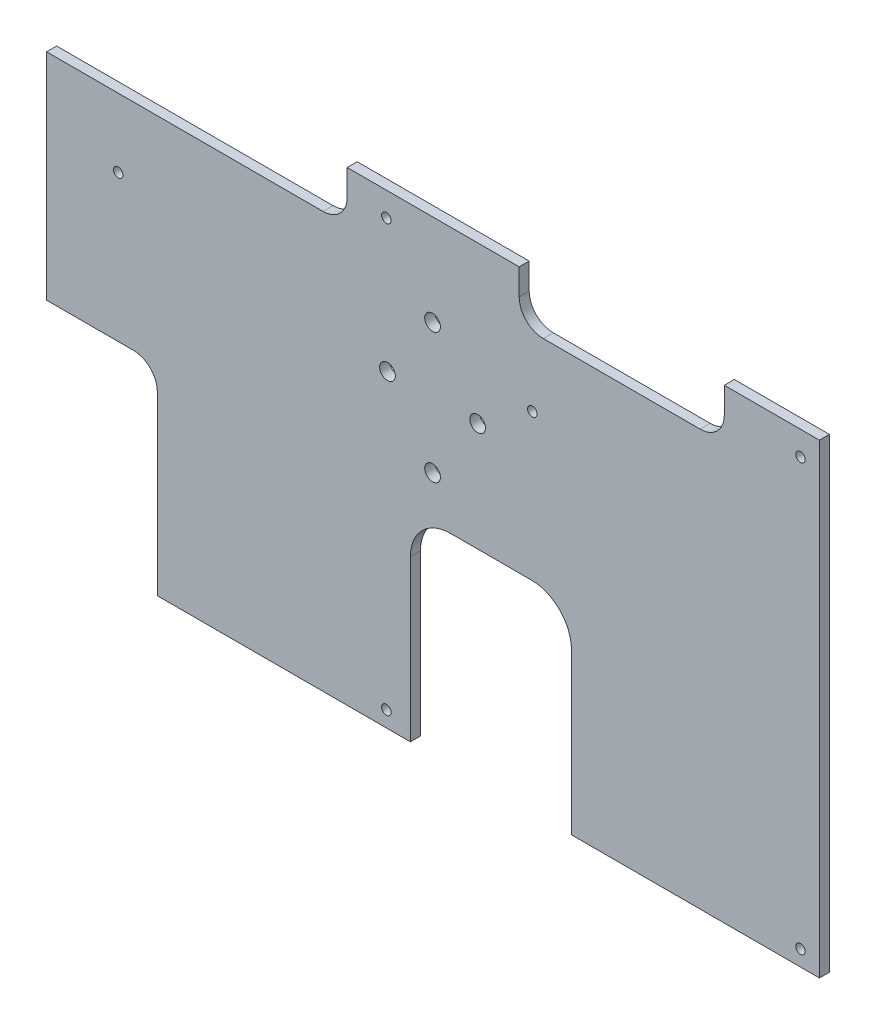
ISO-10303-21;
HEADER;
FILE_DESCRIPTION(('STEP AP214'),'2;1');
FILE_NAME('part.step','',(''),(''),'','','');
FILE_SCHEMA(('AUTOMOTIVE_DESIGN { 1 0 10303 214 1 1 1 1 }'));
ENDSEC;
DATA;
#1=APPLICATION_CONTEXT('core data for automotive mechanical design processes');
#2=APPLICATION_PROTOCOL_DEFINITION('international standard','automotive_design',2000,#1);
#3=PRODUCT_CONTEXT('',#1,'mechanical');
#4=PRODUCT('Part','Part','',(#3));
#5=PRODUCT_RELATED_PRODUCT_CATEGORY('part','',(#4));
#6=PRODUCT_DEFINITION_FORMATION('','',#4);
#7=PRODUCT_DEFINITION_CONTEXT('part definition',#1,'design');
#8=PRODUCT_DEFINITION('design','',#6,#7);
#9=PRODUCT_DEFINITION_SHAPE('','',#8);
#10=(LENGTH_UNIT() NAMED_UNIT(*) SI_UNIT(.MILLI.,.METRE.));
#11=(NAMED_UNIT(*) PLANE_ANGLE_UNIT() SI_UNIT($,.RADIAN.));
#12=(NAMED_UNIT(*) SI_UNIT($,.STERADIAN.) SOLID_ANGLE_UNIT());
#13=UNCERTAINTY_MEASURE_WITH_UNIT(LENGTH_MEASURE(1.E-05),#10,'distance_accuracy_value','');
#14=(GEOMETRIC_REPRESENTATION_CONTEXT(3) GLOBAL_UNCERTAINTY_ASSIGNED_CONTEXT((#13)) GLOBAL_UNIT_ASSIGNED_CONTEXT((#10,
#11,#12)) REPRESENTATION_CONTEXT('',''));
#15=CARTESIAN_POINT('',(0.,0.,0.));
#16=DIRECTION('',(0.,0.,1.));
#17=DIRECTION('',(1.,0.,0.));
#18=AXIS2_PLACEMENT_3D('',#15,#16,#17);
#19=CARTESIAN_POINT('',(290.913803271986,0.,3.175));
#20=DIRECTION('',(-1.,0.,0.));
#21=DIRECTION('',(0.,0.,1.));
#22=AXIS2_PLACEMENT_3D('',#19,#20,#21);
#23=PLANE('',#22);
#24=DIRECTION('',(0.,1.,0.));
#25=VECTOR('',#24,1.);
#26=CARTESIAN_POINT('',(290.913803271986,0.,0.));
#27=LINE('',#26,#25);
#28=CARTESIAN_POINT('',(290.913803271986,301.91999065022,0.));
#29=VERTEX_POINT('',#28);
#30=CARTESIAN_POINT('',(290.913803271986,310.17499065022,0.));
#31=VERTEX_POINT('',#30);
#32=EDGE_CURVE('E246',#29,#31,#27,.T.);
#33=ORIENTED_EDGE('',*,*,#32,.F.);
#34=DIRECTION('',(0.,0.,-1.));
#35=VECTOR('',#34,1.);
#36=CARTESIAN_POINT('',(290.913803271986,301.91999065022,3.175));
#37=LINE('',#36,#35);
#38=CARTESIAN_POINT('',(290.913803271986,301.91999065022,3.175));
#39=VERTEX_POINT('',#38);
#40=EDGE_CURVE('E11',#39,#29,#37,.T.);
#41=ORIENTED_EDGE('',*,*,#40,.F.);
#42=DIRECTION('',(0.,1.,0.));
#43=VECTOR('',#42,1.);
#44=CARTESIAN_POINT('',(290.913803271986,0.,3.175));
#45=LINE('',#44,#43);
#46=CARTESIAN_POINT('',(290.913803271986,310.17499065022,3.175));
#47=VERTEX_POINT('',#46);
#48=EDGE_CURVE('E367',#39,#47,#45,.T.);
#49=ORIENTED_EDGE('',*,*,#48,.T.);
#50=DIRECTION('',(0.,0.,-1.));
#51=VECTOR('',#50,1.);
#52=CARTESIAN_POINT('',(290.913803271986,310.17499065022,3.175));
#53=LINE('',#52,#51);
#54=EDGE_CURVE('E54',#47,#31,#53,.T.);
#55=ORIENTED_EDGE('',*,*,#54,.T.);
#56=EDGE_LOOP('',(#33,#41,#49,#55));
#57=FACE_BOUND('',#56,.T.);
#58=ADVANCED_FACE('F37',(#57),#23,.T.);
#59=CARTESIAN_POINT('',(283.293803271986,301.91999065022,3.175));
#60=DIRECTION('',(0.,0.,-1.));
#61=DIRECTION('',(-1.,0.,0.));
#62=AXIS2_PLACEMENT_3D('',#59,#60,#61);
#63=CYLINDRICAL_SURFACE('',#62,7.62000000000002);
#64=CARTESIAN_POINT('',(283.293803271986,301.91999065022,0.));
#65=DIRECTION('',(0.,0.,1.));
#66=DIRECTION('',(1.,0.,0.));
#67=AXIS2_PLACEMENT_3D('',#64,#65,#66);
#68=CIRCLE('',#67,7.62000000000002);
#69=CARTESIAN_POINT('',(283.293803271986,294.29999065022,0.));
#70=VERTEX_POINT('',#69);
#71=EDGE_CURVE('E248',#29,#70,#68,.F.);
#72=ORIENTED_EDGE('',*,*,#71,.T.);
#73=DIRECTION('',(0.,0.,-1.));
#74=VECTOR('',#73,1.);
#75=CARTESIAN_POINT('',(283.293803271986,294.29999065022,3.175));
#76=LINE('',#75,#74);
#77=CARTESIAN_POINT('',(283.293803271986,294.29999065022,3.175));
#78=VERTEX_POINT('',#77);
#79=EDGE_CURVE('E46',#78,#70,#76,.T.);
#80=ORIENTED_EDGE('',*,*,#79,.F.);
#81=CARTESIAN_POINT('',(283.293803271986,301.91999065022,3.175));
#82=DIRECTION('',(0.,0.,1.));
#83=DIRECTION('',(1.,0.,0.));
#84=AXIS2_PLACEMENT_3D('',#81,#82,#83);
#85=CIRCLE('',#84,7.62000000000002);
#86=EDGE_CURVE('E363',#39,#78,#85,.F.);
#87=ORIENTED_EDGE('',*,*,#86,.F.);
#88=ORIENTED_EDGE('',*,*,#40,.T.);
#89=EDGE_LOOP('',(#72,#80,#87,#88));
#90=FACE_BOUND('',#89,.T.);
#91=ADVANCED_FACE('F350',(#90),#63,.F.);
#92=CARTESIAN_POINT('',(0.,294.29999065022,3.175));
#93=DIRECTION('',(0.,1.,0.));
#94=DIRECTION('',(0.,0.,1.));
#95=AXIS2_PLACEMENT_3D('',#92,#93,#94);
#96=PLANE('',#95);
#97=DIRECTION('',(1.,0.,0.));
#98=VECTOR('',#97,1.);
#99=CARTESIAN_POINT('',(0.,294.29999065022,0.));
#100=LINE('',#99,#98);
#101=CARTESIAN_POINT('',(195.647245606741,294.29999065022,0.));
#102=VERTEX_POINT('',#101);
#103=EDGE_CURVE('E251',#102,#70,#100,.T.);
#104=ORIENTED_EDGE('',*,*,#103,.F.);
#105=DIRECTION('',(0.,0.,-1.));
#106=VECTOR('',#105,1.);
#107=CARTESIAN_POINT('',(195.647245606741,294.29999065022,3.175));
#108=LINE('',#107,#106);
#109=CARTESIAN_POINT('',(195.647245606741,294.29999065022,3.175));
#110=VERTEX_POINT('',#109);
#111=EDGE_CURVE('E340',#110,#102,#108,.T.);
#112=ORIENTED_EDGE('',*,*,#111,.F.);
#113=DIRECTION('',(1.,0.,0.));
#114=VECTOR('',#113,1.);
#115=CARTESIAN_POINT('',(0.,294.29999065022,3.175));
#116=LINE('',#115,#114);
#117=EDGE_CURVE('E347',#110,#78,#116,.T.);
#118=ORIENTED_EDGE('',*,*,#117,.T.);
#119=ORIENTED_EDGE('',*,*,#79,.T.);
#120=EDGE_LOOP('',(#104,#112,#118,#119));
#121=FACE_BOUND('',#120,.T.);
#122=ADVANCED_FACE('F345',(#121),#96,.T.);
#123=CARTESIAN_POINT('',(195.647245606741,0.,3.175));
#124=DIRECTION('',(-1.,0.,0.));
#125=DIRECTION('',(0.,0.,1.));
#126=AXIS2_PLACEMENT_3D('',#123,#124,#125);
#127=PLANE('',#126);
#128=DIRECTION('',(0.,1.,0.));
#129=VECTOR('',#128,1.);
#130=CARTESIAN_POINT('',(195.647245606741,0.,0.));
#131=LINE('',#130,#129);
#132=CARTESIAN_POINT('',(195.647245606741,226.12499065022,0.));
#133=VERTEX_POINT('',#132);
#134=EDGE_CURVE('E254',#133,#102,#131,.T.);
#135=ORIENTED_EDGE('',*,*,#134,.F.);
#136=DIRECTION('',(0.,0.,-1.));
#137=VECTOR('',#136,1.);
#138=CARTESIAN_POINT('',(195.647245606741,226.12499065022,3.175));
#139=LINE('',#138,#137);
#140=CARTESIAN_POINT('',(195.647245606741,226.12499065022,3.175));
#141=VERTEX_POINT('',#140);
#142=EDGE_CURVE('E338',#141,#133,#139,.T.);
#143=ORIENTED_EDGE('',*,*,#142,.F.);
#144=DIRECTION('',(0.,1.,0.));
#145=VECTOR('',#144,1.);
#146=CARTESIAN_POINT('',(195.647245606741,0.,3.175));
#147=LINE('',#146,#145);
#148=EDGE_CURVE('E360',#141,#110,#147,.T.);
#149=ORIENTED_EDGE('',*,*,#148,.T.);
#150=ORIENTED_EDGE('',*,*,#111,.T.);
#151=EDGE_LOOP('',(#135,#143,#149,#150));
#152=FACE_BOUND('',#151,.T.);
#153=ADVANCED_FACE('F357',(#152),#127,.T.);
#154=CARTESIAN_POINT('',(-4.56619081598805E-13,226.124990650219,3.175));
#155=DIRECTION('',(0.,-1.,0.));
#156=DIRECTION('',(1.,0.,0.));
#157=AXIS2_PLACEMENT_3D('',#154,#155,#156);
#158=PLANE('',#157);
#159=DIRECTION('',(-1.,0.,0.));
#160=VECTOR('',#159,1.);
#161=CARTESIAN_POINT('',(-4.56619081598805E-13,226.124990650219,0.));
#162=LINE('',#161,#160);
#163=CARTESIAN_POINT('',(223.137245606741,226.12499065022,0.));
#164=VERTEX_POINT('',#163);
#165=EDGE_CURVE('E257',#164,#133,#162,.T.);
#166=ORIENTED_EDGE('',*,*,#165,.F.);
#167=DIRECTION('',(0.,0.,-1.));
#168=VECTOR('',#167,1.);
#169=CARTESIAN_POINT('',(223.137245606741,226.12499065022,3.175));
#170=LINE('',#169,#168);
#171=CARTESIAN_POINT('',(223.137245606741,226.12499065022,3.175));
#172=VERTEX_POINT('',#171);
#173=EDGE_CURVE('E336',#172,#164,#170,.T.);
#174=ORIENTED_EDGE('',*,*,#173,.F.);
#175=DIRECTION('',(-1.,0.,0.));
#176=VECTOR('',#175,1.);
#177=CARTESIAN_POINT('',(-4.56619081598805E-13,226.124990650219,3.175));
#178=LINE('',#177,#176);
#179=EDGE_CURVE('E365',#172,#141,#178,.T.);
#180=ORIENTED_EDGE('',*,*,#179,.T.);
#181=ORIENTED_EDGE('',*,*,#142,.T.);
#182=EDGE_LOOP('',(#166,#174,#180,#181));
#183=FACE_BOUND('',#182,.T.);
#184=ADVANCED_FACE('F750',(#183),#158,.T.);
#185=CARTESIAN_POINT('',(223.137245606741,218.50499065022,3.175));
#186=DIRECTION('',(0.,0.,-1.));
#187=DIRECTION('',(-1.,0.,0.));
#188=AXIS2_PLACEMENT_3D('',#185,#186,#187);
#189=CYLINDRICAL_SURFACE('',#188,7.62);
#190=CARTESIAN_POINT('',(223.137245606741,218.50499065022,0.));
#191=DIRECTION('',(0.,0.,1.));
#192=DIRECTION('',(1.,0.,0.));
#193=AXIS2_PLACEMENT_3D('',#190,#191,#192);
#194=CIRCLE('',#193,7.62);
#195=CARTESIAN_POINT('',(230.757245606741,218.50499065022,0.));
#196=VERTEX_POINT('',#195);
#197=EDGE_CURVE('E260',#164,#196,#194,.F.);
#198=ORIENTED_EDGE('',*,*,#197,.T.);
#199=DIRECTION('',(0.,0.,-1.));
#200=VECTOR('',#199,1.);
#201=CARTESIAN_POINT('',(230.757245606741,218.50499065022,3.175));
#202=LINE('',#201,#200);
#203=CARTESIAN_POINT('',(230.757245606741,218.50499065022,3.175));
#204=VERTEX_POINT('',#203);
#205=EDGE_CURVE('E334',#204,#196,#202,.T.);
#206=ORIENTED_EDGE('',*,*,#205,.F.);
#207=CARTESIAN_POINT('',(223.137245606741,218.50499065022,3.175));
#208=DIRECTION('',(0.,0.,1.));
#209=DIRECTION('',(1.,0.,0.));
#210=AXIS2_PLACEMENT_3D('',#207,#208,#209);
#211=CIRCLE('',#210,7.62);
#212=EDGE_CURVE('E372',#172,#204,#211,.F.);
#213=ORIENTED_EDGE('',*,*,#212,.F.);
#214=ORIENTED_EDGE('',*,*,#173,.T.);
#215=EDGE_LOOP('',(#198,#206,#213,#214));
#216=FACE_BOUND('',#215,.T.);
#217=ADVANCED_FACE('F740',(#216),#189,.F.);
#218=CARTESIAN_POINT('',(230.757245606741,0.,3.175));
#219=DIRECTION('',(-1.,0.,0.));
#220=DIRECTION('',(0.,0.,1.));
#221=AXIS2_PLACEMENT_3D('',#218,#219,#220);
#222=PLANE('',#221);
#223=DIRECTION('',(0.,1.,0.));
#224=VECTOR('',#223,1.);
#225=CARTESIAN_POINT('',(230.757245606741,0.,0.));
#226=LINE('',#225,#224);
#227=CARTESIAN_POINT('',(230.757245606741,162.55499065022,0.));
#228=VERTEX_POINT('',#227);
#229=EDGE_CURVE('E263',#228,#196,#226,.T.);
#230=ORIENTED_EDGE('',*,*,#229,.F.);
#231=DIRECTION('',(0.,0.,-1.));
#232=VECTOR('',#231,1.);
#233=CARTESIAN_POINT('',(230.757245606741,162.55499065022,3.175));
#234=LINE('',#233,#232);
#235=CARTESIAN_POINT('',(230.757245606741,162.55499065022,3.175));
#236=VERTEX_POINT('',#235);
#237=EDGE_CURVE('E332',#236,#228,#234,.T.);
#238=ORIENTED_EDGE('',*,*,#237,.F.);
#239=DIRECTION('',(0.,1.,0.));
#240=VECTOR('',#239,1.);
#241=CARTESIAN_POINT('',(230.757245606741,0.,3.175));
#242=LINE('',#241,#240);
#243=EDGE_CURVE('E374',#236,#204,#242,.T.);
#244=ORIENTED_EDGE('',*,*,#243,.T.);
#245=ORIENTED_EDGE('',*,*,#205,.T.);
#246=EDGE_LOOP('',(#230,#238,#244,#245));
#247=FACE_BOUND('',#246,.T.);
#248=ADVANCED_FACE('F730',(#247),#222,.T.);
#249=CARTESIAN_POINT('',(0.,162.55499065022,3.175));
#250=DIRECTION('',(0.,-1.,0.));
#251=DIRECTION('',(0.,0.,-1.));
#252=AXIS2_PLACEMENT_3D('',#249,#250,#251);
#253=PLANE('',#252);
#254=DIRECTION('',(-1.,0.,0.));
#255=VECTOR('',#254,1.);
#256=CARTESIAN_POINT('',(0.,162.55499065022,0.));
#257=LINE('',#256,#255);
#258=CARTESIAN_POINT('',(310.967245606741,162.55499065022,0.));
#259=VERTEX_POINT('',#258);
#260=EDGE_CURVE('E266',#259,#228,#257,.T.);
#261=ORIENTED_EDGE('',*,*,#260,.F.);
#262=DIRECTION('',(0.,0.,-1.));
#263=VECTOR('',#262,1.);
#264=CARTESIAN_POINT('',(310.967245606741,162.55499065022,3.175));
#265=LINE('',#264,#263);
#266=CARTESIAN_POINT('',(310.967245606741,162.55499065022,3.175));
#267=VERTEX_POINT('',#266);
#268=EDGE_CURVE('E330',#267,#259,#265,.T.);
#269=ORIENTED_EDGE('',*,*,#268,.F.);
#270=DIRECTION('',(-1.,0.,0.));
#271=VECTOR('',#270,1.);
#272=CARTESIAN_POINT('',(0.,162.55499065022,3.175));
#273=LINE('',#272,#271);
#274=EDGE_CURVE('E377',#267,#236,#273,.T.);
#275=ORIENTED_EDGE('',*,*,#274,.T.);
#276=ORIENTED_EDGE('',*,*,#237,.T.);
#277=EDGE_LOOP('',(#261,#269,#275,#276));
#278=FACE_BOUND('',#277,.T.);
#279=ADVANCED_FACE('F720',(#278),#253,.T.);
#280=CARTESIAN_POINT('',(310.967245606741,0.,3.175));
#281=DIRECTION('',(1.,0.,0.));
#282=DIRECTION('',(0.,0.,-1.));
#283=AXIS2_PLACEMENT_3D('',#280,#281,#282);
#284=PLANE('',#283);
#285=DIRECTION('',(0.,-1.,0.));
#286=VECTOR('',#285,1.);
#287=CARTESIAN_POINT('',(310.967245606741,0.,0.));
#288=LINE('',#287,#286);
#289=CARTESIAN_POINT('',(310.967245606741,213.42499065022,0.));
#290=VERTEX_POINT('',#289);
#291=EDGE_CURVE('E269',#290,#259,#288,.T.);
#292=ORIENTED_EDGE('',*,*,#291,.F.);
#293=DIRECTION('',(0.,0.,-1.));
#294=VECTOR('',#293,1.);
#295=CARTESIAN_POINT('',(310.967245606741,213.42499065022,3.175));
#296=LINE('',#295,#294);
#297=CARTESIAN_POINT('',(310.967245606741,213.42499065022,3.175));
#298=VERTEX_POINT('',#297);
#299=EDGE_CURVE('E328',#298,#290,#296,.T.);
#300=ORIENTED_EDGE('',*,*,#299,.F.);
#301=DIRECTION('',(0.,-1.,0.));
#302=VECTOR('',#301,1.);
#303=CARTESIAN_POINT('',(310.967245606741,0.,3.175));
#304=LINE('',#303,#302);
#305=EDGE_CURVE('E380',#298,#267,#304,.T.);
#306=ORIENTED_EDGE('',*,*,#305,.T.);
#307=ORIENTED_EDGE('',*,*,#268,.T.);
#308=EDGE_LOOP('',(#292,#300,#306,#307));
#309=FACE_BOUND('',#308,.T.);
#310=ADVANCED_FACE('F710',(#309),#284,.T.);
#311=CARTESIAN_POINT('',(323.667245606741,213.42499065022,3.175));
#312=DIRECTION('',(0.,0.,-1.));
#313=DIRECTION('',(-1.,0.,0.));
#314=AXIS2_PLACEMENT_3D('',#311,#312,#313);
#315=CYLINDRICAL_SURFACE('',#314,12.7);
#316=CARTESIAN_POINT('',(323.667245606741,213.42499065022,0.));
#317=DIRECTION('',(0.,0.,1.));
#318=DIRECTION('',(1.,0.,0.));
#319=AXIS2_PLACEMENT_3D('',#316,#317,#318);
#320=CIRCLE('',#319,12.7);
#321=CARTESIAN_POINT('',(323.667245606741,226.12499065022,0.));
#322=VERTEX_POINT('',#321);
#323=EDGE_CURVE('E272',#322,#290,#320,.T.);
#324=ORIENTED_EDGE('',*,*,#323,.F.);
#325=DIRECTION('',(0.,0.,-1.));
#326=VECTOR('',#325,1.);
#327=CARTESIAN_POINT('',(323.667245606741,226.12499065022,3.175));
#328=LINE('',#327,#326);
#329=CARTESIAN_POINT('',(323.667245606741,226.12499065022,3.175));
#330=VERTEX_POINT('',#329);
#331=EDGE_CURVE('E326',#330,#322,#328,.T.);
#332=ORIENTED_EDGE('',*,*,#331,.F.);
#333=CARTESIAN_POINT('',(323.667245606741,213.42499065022,3.175));
#334=DIRECTION('',(0.,0.,1.));
#335=DIRECTION('',(1.,0.,0.));
#336=AXIS2_PLACEMENT_3D('',#333,#334,#335);
#337=CIRCLE('',#336,12.7);
#338=EDGE_CURVE('E383',#330,#298,#337,.T.);
#339=ORIENTED_EDGE('',*,*,#338,.T.);
#340=ORIENTED_EDGE('',*,*,#299,.T.);
#341=EDGE_LOOP('',(#324,#332,#339,#340));
#342=FACE_BOUND('',#341,.T.);
#343=ADVANCED_FACE('F700',(#342),#315,.F.);
#344=CARTESIAN_POINT('',(-1.2239136654788E-12,226.124990650218,3.175));
#345=DIRECTION('',(0.,-1.,0.));
#346=DIRECTION('',(1.,0.,0.));
#347=AXIS2_PLACEMENT_3D('',#344,#345,#346);
#348=PLANE('',#347);
#349=DIRECTION('',(-1.,0.,0.));
#350=VECTOR('',#349,1.);
#351=CARTESIAN_POINT('',(-1.2239136654788E-12,226.124990650218,0.));
#352=LINE('',#351,#350);
#353=CARTESIAN_POINT('',(349.307245606742,226.12499065022,0.));
#354=VERTEX_POINT('',#353);
#355=EDGE_CURVE('E275',#354,#322,#352,.T.);
#356=ORIENTED_EDGE('',*,*,#355,.F.);
#357=DIRECTION('',(0.,0.,-1.));
#358=VECTOR('',#357,1.);
#359=CARTESIAN_POINT('',(349.307245606742,226.12499065022,3.175));
#360=LINE('',#359,#358);
#361=CARTESIAN_POINT('',(349.307245606742,226.12499065022,3.175));
#362=VERTEX_POINT('',#361);
#363=EDGE_CURVE('E324',#362,#354,#360,.T.);
#364=ORIENTED_EDGE('',*,*,#363,.F.);
#365=DIRECTION('',(-1.,0.,0.));
#366=VECTOR('',#365,1.);
#367=CARTESIAN_POINT('',(-1.2239136654788E-12,226.124990650218,3.175));
#368=LINE('',#367,#366);
#369=EDGE_CURVE('E386',#362,#330,#368,.T.);
#370=ORIENTED_EDGE('',*,*,#369,.T.);
#371=ORIENTED_EDGE('',*,*,#331,.T.);
#372=EDGE_LOOP('',(#356,#364,#370,#371));
#373=FACE_BOUND('',#372,.T.);
#374=ADVANCED_FACE('F690',(#373),#348,.T.);
#375=CARTESIAN_POINT('',(349.307245606742,213.42499065022,3.175));
#376=DIRECTION('',(0.,0.,-1.));
#377=DIRECTION('',(-1.,0.,0.));
#378=AXIS2_PLACEMENT_3D('',#375,#376,#377);
#379=CYLINDRICAL_SURFACE('',#378,12.7);
#380=CARTESIAN_POINT('',(349.307245606742,213.42499065022,0.));
#381=DIRECTION('',(0.,0.,1.));
#382=DIRECTION('',(1.,0.,0.));
#383=AXIS2_PLACEMENT_3D('',#380,#381,#382);
#384=CIRCLE('',#383,12.7);
#385=CARTESIAN_POINT('',(362.007245606742,213.42499065022,0.));
#386=VERTEX_POINT('',#385);
#387=EDGE_CURVE('E278',#386,#354,#384,.T.);
#388=ORIENTED_EDGE('',*,*,#387,.F.);
#389=DIRECTION('',(0.,0.,-1.));
#390=VECTOR('',#389,1.);
#391=CARTESIAN_POINT('',(362.007245606742,213.42499065022,3.175));
#392=LINE('',#391,#390);
#393=CARTESIAN_POINT('',(362.007245606742,213.42499065022,3.175));
#394=VERTEX_POINT('',#393);
#395=EDGE_CURVE('E322',#394,#386,#392,.T.);
#396=ORIENTED_EDGE('',*,*,#395,.F.);
#397=CARTESIAN_POINT('',(349.307245606742,213.42499065022,3.175));
#398=DIRECTION('',(0.,0.,1.));
#399=DIRECTION('',(1.,0.,0.));
#400=AXIS2_PLACEMENT_3D('',#397,#398,#399);
#401=CIRCLE('',#400,12.7);
#402=EDGE_CURVE('E389',#394,#362,#401,.T.);
#403=ORIENTED_EDGE('',*,*,#402,.T.);
#404=ORIENTED_EDGE('',*,*,#363,.T.);
#405=EDGE_LOOP('',(#388,#396,#403,#404));
#406=FACE_BOUND('',#405,.T.);
#407=ADVANCED_FACE('F680',(#406),#379,.F.);
#408=CARTESIAN_POINT('',(362.007245606742,0.,3.175));
#409=DIRECTION('',(-1.,0.,0.));
#410=DIRECTION('',(0.,0.,1.));
#411=AXIS2_PLACEMENT_3D('',#408,#409,#410);
#412=PLANE('',#411);
#413=DIRECTION('',(0.,1.,0.));
#414=VECTOR('',#413,1.);
#415=CARTESIAN_POINT('',(362.007245606742,0.,0.));
#416=LINE('',#415,#414);
#417=CARTESIAN_POINT('',(362.007245606742,162.55499065022,0.));
#418=VERTEX_POINT('',#417);
#419=EDGE_CURVE('E281',#418,#386,#416,.T.);
#420=ORIENTED_EDGE('',*,*,#419,.F.);
#421=DIRECTION('',(0.,0.,-1.));
#422=VECTOR('',#421,1.);
#423=CARTESIAN_POINT('',(362.007245606742,162.55499065022,3.175));
#424=LINE('',#423,#422);
#425=CARTESIAN_POINT('',(362.007245606742,162.55499065022,3.175));
#426=VERTEX_POINT('',#425);
#427=EDGE_CURVE('E320',#426,#418,#424,.T.);
#428=ORIENTED_EDGE('',*,*,#427,.F.);
#429=DIRECTION('',(0.,1.,0.));
#430=VECTOR('',#429,1.);
#431=CARTESIAN_POINT('',(362.007245606742,0.,3.175));
#432=LINE('',#431,#430);
#433=EDGE_CURVE('E392',#426,#394,#432,.T.);
#434=ORIENTED_EDGE('',*,*,#433,.T.);
#435=ORIENTED_EDGE('',*,*,#395,.T.);
#436=EDGE_LOOP('',(#420,#428,#434,#435));
#437=FACE_BOUND('',#436,.T.);
#438=ADVANCED_FACE('F670',(#437),#412,.T.);
#439=CARTESIAN_POINT('',(0.,162.55499065022,3.175));
#440=DIRECTION('',(0.,-1.,0.));
#441=DIRECTION('',(0.,0.,-1.));
#442=AXIS2_PLACEMENT_3D('',#439,#440,#441);
#443=PLANE('',#442);
#444=DIRECTION('',(-1.,0.,0.));
#445=VECTOR('',#444,1.);
#446=CARTESIAN_POINT('',(0.,162.55499065022,0.));
#447=LINE('',#446,#445);
#448=CARTESIAN_POINT('',(440.597245606742,162.55499065022,0.));
#449=VERTEX_POINT('',#448);
#450=EDGE_CURVE('E284',#449,#418,#447,.T.);
#451=ORIENTED_EDGE('',*,*,#450,.F.);
#452=DIRECTION('',(0.,0.,-1.));
#453=VECTOR('',#452,1.);
#454=CARTESIAN_POINT('',(440.597245606742,162.55499065022,3.175));
#455=LINE('',#454,#453);
#456=CARTESIAN_POINT('',(440.597245606742,162.55499065022,3.175));
#457=VERTEX_POINT('',#456);
#458=EDGE_CURVE('E318',#457,#449,#455,.T.);
#459=ORIENTED_EDGE('',*,*,#458,.F.);
#460=DIRECTION('',(-1.,0.,0.));
#461=VECTOR('',#460,1.);
#462=CARTESIAN_POINT('',(0.,162.55499065022,3.175));
#463=LINE('',#462,#461);
#464=EDGE_CURVE('E395',#457,#426,#463,.T.);
#465=ORIENTED_EDGE('',*,*,#464,.T.);
#466=ORIENTED_EDGE('',*,*,#427,.T.);
#467=EDGE_LOOP('',(#451,#459,#465,#466));
#468=FACE_BOUND('',#467,.T.);
#469=ADVANCED_FACE('F660',(#468),#443,.T.);
#470=CARTESIAN_POINT('',(440.597245606742,0.,3.175));
#471=DIRECTION('',(1.,0.,0.));
#472=DIRECTION('',(0.,0.,-1.));
#473=AXIS2_PLACEMENT_3D('',#470,#471,#472);
#474=PLANE('',#473);
#475=DIRECTION('',(0.,-1.,0.));
#476=VECTOR('',#475,1.);
#477=CARTESIAN_POINT('',(440.597245606742,0.,0.));
#478=LINE('',#477,#476);
#479=CARTESIAN_POINT('',(440.597245606742,310.17499065022,0.));
#480=VERTEX_POINT('',#479);
#481=EDGE_CURVE('E287',#480,#449,#478,.T.);
#482=ORIENTED_EDGE('',*,*,#481,.F.);
#483=DIRECTION('',(0.,0.,-1.));
#484=VECTOR('',#483,1.);
#485=CARTESIAN_POINT('',(440.597245606742,310.17499065022,3.175));
#486=LINE('',#485,#484);
#487=CARTESIAN_POINT('',(440.597245606742,310.17499065022,3.175));
#488=VERTEX_POINT('',#487);
#489=EDGE_CURVE('E316',#488,#480,#486,.T.);
#490=ORIENTED_EDGE('',*,*,#489,.F.);
#491=DIRECTION('',(0.,-1.,0.));
#492=VECTOR('',#491,1.);
#493=CARTESIAN_POINT('',(440.597245606742,0.,3.175));
#494=LINE('',#493,#492);
#495=EDGE_CURVE('E398',#488,#457,#494,.T.);
#496=ORIENTED_EDGE('',*,*,#495,.T.);
#497=ORIENTED_EDGE('',*,*,#458,.T.);
#498=EDGE_LOOP('',(#482,#490,#496,#497));
#499=FACE_BOUND('',#498,.T.);
#500=ADVANCED_FACE('F458',(#499),#474,.T.);
#501=CARTESIAN_POINT('',(-2.10877780944743E-13,310.17499065022,3.175));
#502=DIRECTION('',(0.,1.,0.));
#503=DIRECTION('',(-1.,0.,0.));
#504=AXIS2_PLACEMENT_3D('',#501,#502,#503);
#505=PLANE('',#504);
#506=DIRECTION('',(1.,0.,0.));
#507=VECTOR('',#506,1.);
#508=CARTESIAN_POINT('',(-2.10877780944743E-13,310.17499065022,0.));
#509=LINE('',#508,#507);
#510=CARTESIAN_POINT('',(410.434211886956,310.17499065022,0.));
#511=VERTEX_POINT('',#510);
#512=EDGE_CURVE('E290',#511,#480,#509,.T.);
#513=ORIENTED_EDGE('',*,*,#512,.F.);
#514=DIRECTION('',(0.,0.,-1.));
#515=VECTOR('',#514,1.);
#516=CARTESIAN_POINT('',(410.434211886956,310.17499065022,3.175));
#517=LINE('',#516,#515);
#518=CARTESIAN_POINT('',(410.434211886956,310.17499065022,3.175));
#519=VERTEX_POINT('',#518);
#520=EDGE_CURVE('E314',#519,#511,#517,.T.);
#521=ORIENTED_EDGE('',*,*,#520,.F.);
#522=DIRECTION('',(1.,0.,0.));
#523=VECTOR('',#522,1.);
#524=CARTESIAN_POINT('',(-2.10877780944743E-13,310.17499065022,3.175));
#525=LINE('',#524,#523);
#526=EDGE_CURVE('E213',#519,#488,#525,.T.);
#527=ORIENTED_EDGE('',*,*,#526,.T.);
#528=ORIENTED_EDGE('',*,*,#489,.T.);
#529=EDGE_LOOP('',(#513,#521,#527,#528));
#530=FACE_BOUND('',#529,.T.);
#531=ADVANCED_FACE('F446',(#530),#505,.T.);
#532=CARTESIAN_POINT('',(410.434211886954,-2.75998493113735E-12,3.175));
#533=DIRECTION('',(1.,0.,0.));
#534=DIRECTION('',(0.,1.,0.));
#535=AXIS2_PLACEMENT_3D('',#532,#533,#534);
#536=PLANE('',#535);
#537=DIRECTION('',(0.,-1.,0.));
#538=VECTOR('',#537,1.);
#539=CARTESIAN_POINT('',(410.434211886954,-2.75998493113735E-12,0.));
#540=LINE('',#539,#538);
#541=CARTESIAN_POINT('',(410.434211886956,301.91999065022,0.));
#542=VERTEX_POINT('',#541);
#543=EDGE_CURVE('E293',#511,#542,#540,.T.);
#544=ORIENTED_EDGE('',*,*,#543,.T.);
#545=DIRECTION('',(0.,0.,-1.));
#546=VECTOR('',#545,1.);
#547=CARTESIAN_POINT('',(410.434211886956,301.91999065022,3.175));
#548=LINE('',#547,#546);
#549=CARTESIAN_POINT('',(410.434211886956,301.91999065022,3.175));
#550=VERTEX_POINT('',#549);
#551=EDGE_CURVE('E311',#550,#542,#548,.T.);
#552=ORIENTED_EDGE('',*,*,#551,.F.);
#553=DIRECTION('',(0.,-1.,0.));
#554=VECTOR('',#553,1.);
#555=CARTESIAN_POINT('',(410.434211886954,-2.75998493113735E-12,3.175));
#556=LINE('',#555,#554);
#557=EDGE_CURVE('E402',#519,#550,#556,.T.);
#558=ORIENTED_EDGE('',*,*,#557,.F.);
#559=ORIENTED_EDGE('',*,*,#520,.T.);
#560=EDGE_LOOP('',(#544,#552,#558,#559));
#561=FACE_BOUND('',#560,.T.);
#562=ADVANCED_FACE('F457',(#561),#536,.F.);
#563=CARTESIAN_POINT('',(402.814211886956,301.91999065022,3.175));
#564=DIRECTION('',(0.,0.,-1.));
#565=DIRECTION('',(-1.,0.,0.));
#566=AXIS2_PLACEMENT_3D('',#563,#564,#565);
#567=CYLINDRICAL_SURFACE('',#566,7.61999999999999);
#568=CARTESIAN_POINT('',(402.814211886956,301.91999065022,0.));
#569=DIRECTION('',(0.,0.,1.));
#570=DIRECTION('',(1.,0.,0.));
#571=AXIS2_PLACEMENT_3D('',#568,#569,#570);
#572=CIRCLE('',#571,7.61999999999999);
#573=CARTESIAN_POINT('',(402.814211886956,294.29999065022,0.));
#574=VERTEX_POINT('',#573);
#575=EDGE_CURVE('E297',#542,#574,#572,.F.);
#576=ORIENTED_EDGE('',*,*,#575,.T.);
#577=DIRECTION('',(0.,0.,-1.));
#578=VECTOR('',#577,1.);
#579=CARTESIAN_POINT('',(402.814211886956,294.29999065022,3.175));
#580=LINE('',#579,#578);
#581=CARTESIAN_POINT('',(402.814211886956,294.29999065022,3.175));
#582=VERTEX_POINT('',#581);
#583=EDGE_CURVE('E309',#582,#574,#580,.T.);
#584=ORIENTED_EDGE('',*,*,#583,.F.);
#585=CARTESIAN_POINT('',(402.814211886956,301.91999065022,3.175));
#586=DIRECTION('',(0.,0.,1.));
#587=DIRECTION('',(1.,0.,0.));
#588=AXIS2_PLACEMENT_3D('',#585,#586,#587);
#589=CIRCLE('',#588,7.61999999999999);
#590=EDGE_CURVE('E405',#550,#582,#589,.F.);
#591=ORIENTED_EDGE('',*,*,#590,.F.);
#592=ORIENTED_EDGE('',*,*,#551,.T.);
#593=EDGE_LOOP('',(#576,#584,#591,#592));
#594=FACE_BOUND('',#593,.T.);
#595=ADVANCED_FACE('F627',(#594),#567,.F.);
#596=CARTESIAN_POINT('',(0.,294.29999065022,3.175));
#597=DIRECTION('',(0.,1.,0.));
#598=DIRECTION('',(0.,0.,1.));
#599=AXIS2_PLACEMENT_3D('',#596,#597,#598);
#600=PLANE('',#599);
#601=DIRECTION('',(1.,0.,0.));
#602=VECTOR('',#601,1.);
#603=CARTESIAN_POINT('',(0.,294.29999065022,0.));
#604=LINE('',#603,#602);
#605=CARTESIAN_POINT('',(353.054686067426,294.29999065022,0.));
#606=VERTEX_POINT('',#605);
#607=EDGE_CURVE('E300',#606,#574,#604,.T.);
#608=ORIENTED_EDGE('',*,*,#607,.F.);
#609=DIRECTION('',(0.,0.,-1.));
#610=VECTOR('',#609,1.);
#611=CARTESIAN_POINT('',(353.054686067426,294.29999065022,3.175));
#612=LINE('',#611,#610);
#613=CARTESIAN_POINT('',(353.054686067426,294.29999065022,3.175));
#614=VERTEX_POINT('',#613);
#615=EDGE_CURVE('E197',#614,#606,#612,.T.);
#616=ORIENTED_EDGE('',*,*,#615,.F.);
#617=DIRECTION('',(1.,0.,0.));
#618=VECTOR('',#617,1.);
#619=CARTESIAN_POINT('',(0.,294.29999065022,3.175));
#620=LINE('',#619,#618);
#621=EDGE_CURVE('E207',#614,#582,#620,.T.);
#622=ORIENTED_EDGE('',*,*,#621,.T.);
#623=ORIENTED_EDGE('',*,*,#583,.T.);
#624=EDGE_LOOP('',(#608,#616,#622,#623));
#625=FACE_BOUND('',#624,.T.);
#626=ADVANCED_FACE('F408',(#625),#600,.T.);
#627=CARTESIAN_POINT('',(353.054686067426,301.91999065022,3.175));
#628=DIRECTION('',(0.,0.,-1.));
#629=DIRECTION('',(-1.,0.,0.));
#630=AXIS2_PLACEMENT_3D('',#627,#628,#629);
#631=CYLINDRICAL_SURFACE('',#630,7.62000000000002);
#632=CARTESIAN_POINT('',(353.054686067426,301.91999065022,0.));
#633=DIRECTION('',(0.,0.,1.));
#634=DIRECTION('',(1.,0.,0.));
#635=AXIS2_PLACEMENT_3D('',#632,#633,#634);
#636=CIRCLE('',#635,7.62000000000002);
#637=CARTESIAN_POINT('',(345.434686067426,301.91999065022,0.));
#638=VERTEX_POINT('',#637);
#639=EDGE_CURVE('E193',#638,#606,#636,.T.);
#640=ORIENTED_EDGE('',*,*,#639,.F.);
#641=DIRECTION('',(0.,0.,-1.));
#642=VECTOR('',#641,1.);
#643=CARTESIAN_POINT('',(345.434686067426,301.91999065022,3.175));
#644=LINE('',#643,#642);
#645=CARTESIAN_POINT('',(345.434686067426,301.91999065022,3.175));
#646=VERTEX_POINT('',#645);
#647=EDGE_CURVE('E188',#646,#638,#644,.T.);
#648=ORIENTED_EDGE('',*,*,#647,.F.);
#649=CARTESIAN_POINT('',(353.054686067426,301.91999065022,3.175));
#650=DIRECTION('',(0.,0.,1.));
#651=DIRECTION('',(1.,0.,0.));
#652=AXIS2_PLACEMENT_3D('',#649,#650,#651);
#653=CIRCLE('',#652,7.62000000000002);
#654=EDGE_CURVE('E191',#646,#614,#653,.T.);
#655=ORIENTED_EDGE('',*,*,#654,.T.);
#656=ORIENTED_EDGE('',*,*,#615,.T.);
#657=EDGE_LOOP('',(#640,#648,#655,#656));
#658=FACE_BOUND('',#657,.T.);
#659=ADVANCED_FACE('F190',(#658),#631,.F.);
#660=CARTESIAN_POINT('',(345.434686067426,0.,3.175));
#661=DIRECTION('',(1.,0.,0.));
#662=DIRECTION('',(0.,0.,-1.));
#663=AXIS2_PLACEMENT_3D('',#660,#661,#662);
#664=PLANE('',#663);
#665=DIRECTION('',(0.,-1.,0.));
#666=VECTOR('',#665,1.);
#667=CARTESIAN_POINT('',(345.434686067426,0.,0.));
#668=LINE('',#667,#666);
#669=CARTESIAN_POINT('',(345.434686067426,310.17499065022,0.));
#670=VERTEX_POINT('',#669);
#671=EDGE_CURVE('E304',#670,#638,#668,.T.);
#672=ORIENTED_EDGE('',*,*,#671,.F.);
#673=DIRECTION('',(0.,0.,-1.));
#674=VECTOR('',#673,1.);
#675=CARTESIAN_POINT('',(345.434686067426,310.17499065022,3.175));
#676=LINE('',#675,#674);
#677=CARTESIAN_POINT('',(345.434686067426,310.17499065022,3.175));
#678=VERTEX_POINT('',#677);
#679=EDGE_CURVE('E121',#678,#670,#676,.T.);
#680=ORIENTED_EDGE('',*,*,#679,.F.);
#681=DIRECTION('',(0.,-1.,0.));
#682=VECTOR('',#681,1.);
#683=CARTESIAN_POINT('',(345.434686067426,0.,3.175));
#684=LINE('',#683,#682);
#685=EDGE_CURVE('E205',#678,#646,#684,.T.);
#686=ORIENTED_EDGE('',*,*,#685,.T.);
#687=ORIENTED_EDGE('',*,*,#647,.T.);
#688=EDGE_LOOP('',(#672,#680,#686,#687));
#689=FACE_BOUND('',#688,.T.);
#690=ADVANCED_FACE('F209',(#689),#664,.T.);
#691=CARTESIAN_POINT('',(349.597245606742,272.55499065022,3.175));
#692=DIRECTION('',(0.,0.,-1.));
#693=DIRECTION('',(-1.,0.,0.));
#694=AXIS2_PLACEMENT_3D('',#691,#692,#693);
#695=CYLINDRICAL_SURFACE('',#694,1.50000000000002);
#696=CARTESIAN_POINT('',(349.597245606742,272.55499065022,3.175));
#697=DIRECTION('',(0.,0.,1.));
#698=DIRECTION('',(1.,0.,0.));
#699=AXIS2_PLACEMENT_3D('',#696,#697,#698);
#700=CIRCLE('',#699,1.50000000000002);
#701=CARTESIAN_POINT('',(351.097245606742,272.55499065022,3.175));
#702=VERTEX_POINT('',#701);
#703=EDGE_CURVE('E441',#702,#702,#700,.T.);
#704=ORIENTED_EDGE('',*,*,#703,.T.);
#705=EDGE_LOOP('',(#704));
#706=FACE_BOUND('',#705,.T.);
#707=CARTESIAN_POINT('',(349.597245606742,272.55499065022,0.));
#708=DIRECTION('',(0.,0.,1.));
#709=DIRECTION('',(1.,0.,0.));
#710=AXIS2_PLACEMENT_3D('',#707,#708,#709);
#711=CIRCLE('',#710,1.50000000000002);
#712=CARTESIAN_POINT('',(351.097245606742,272.55499065022,0.));
#713=VERTEX_POINT('',#712);
#714=EDGE_CURVE('E243',#713,#713,#711,.T.);
#715=ORIENTED_EDGE('',*,*,#714,.F.);
#716=EDGE_LOOP('',(#715));
#717=FACE_BOUND('',#716,.T.);
#718=ADVANCED_FACE('F468',(#706,#717),#695,.F.);
#719=CARTESIAN_POINT('',(434.597245606742,167.55499065022,3.175));
#720=DIRECTION('',(0.,0.,-1.));
#721=DIRECTION('',(-1.,0.,0.));
#722=AXIS2_PLACEMENT_3D('',#719,#720,#721);
#723=CYLINDRICAL_SURFACE('',#722,1.49999999999996);
#724=CARTESIAN_POINT('',(434.597245606742,167.55499065022,3.175));
#725=DIRECTION('',(0.,0.,1.));
#726=DIRECTION('',(1.,0.,0.));
#727=AXIS2_PLACEMENT_3D('',#724,#725,#726);
#728=CIRCLE('',#727,1.49999999999996);
#729=CARTESIAN_POINT('',(436.097245606742,167.55499065022,3.175));
#730=VERTEX_POINT('',#729);
#731=EDGE_CURVE('E438',#730,#730,#728,.T.);
#732=ORIENTED_EDGE('',*,*,#731,.T.);
#733=EDGE_LOOP('',(#732));
#734=FACE_BOUND('',#733,.T.);
#735=CARTESIAN_POINT('',(434.597245606742,167.55499065022,0.));
#736=DIRECTION('',(0.,0.,1.));
#737=DIRECTION('',(1.,0.,0.));
#738=AXIS2_PLACEMENT_3D('',#735,#736,#737);
#739=CIRCLE('',#738,1.49999999999996);
#740=CARTESIAN_POINT('',(436.097245606742,167.55499065022,0.));
#741=VERTEX_POINT('',#740);
#742=EDGE_CURVE('E240',#741,#741,#739,.T.);
#743=ORIENTED_EDGE('',*,*,#742,.F.);
#744=EDGE_LOOP('',(#743));
#745=FACE_BOUND('',#744,.T.);
#746=ADVANCED_FACE('F471',(#734,#745),#723,.F.);
#747=CARTESIAN_POINT('',(434.597245606742,302.55499065022,3.175));
#748=DIRECTION('',(0.,0.,-1.));
#749=DIRECTION('',(-1.,0.,0.));
#750=AXIS2_PLACEMENT_3D('',#747,#748,#749);
#751=CYLINDRICAL_SURFACE('',#750,1.50000000000002);
#752=CARTESIAN_POINT('',(434.597245606742,302.55499065022,3.175));
#753=DIRECTION('',(0.,0.,1.));
#754=DIRECTION('',(1.,0.,0.));
#755=AXIS2_PLACEMENT_3D('',#752,#753,#754);
#756=CIRCLE('',#755,1.50000000000002);
#757=CARTESIAN_POINT('',(436.097245606742,302.55499065022,3.175));
#758=VERTEX_POINT('',#757);
#759=EDGE_CURVE('E435',#758,#758,#756,.T.);
#760=ORIENTED_EDGE('',*,*,#759,.T.);
#761=EDGE_LOOP('',(#760));
#762=FACE_BOUND('',#761,.T.);
#763=CARTESIAN_POINT('',(434.597245606742,302.55499065022,0.));
#764=DIRECTION('',(0.,0.,1.));
#765=DIRECTION('',(1.,0.,0.));
#766=AXIS2_PLACEMENT_3D('',#763,#764,#765);
#767=CIRCLE('',#766,1.50000000000002);
#768=CARTESIAN_POINT('',(436.097245606742,302.55499065022,0.));
#769=VERTEX_POINT('',#768);
#770=EDGE_CURVE('E237',#769,#769,#767,.T.);
#771=ORIENTED_EDGE('',*,*,#770,.F.);
#772=EDGE_LOOP('',(#771));
#773=FACE_BOUND('',#772,.T.);
#774=ADVANCED_FACE('F475',(#762,#773),#751,.F.);
#775=CARTESIAN_POINT('',(332.277245606742,260.57099065022,3.175));
#776=DIRECTION('',(0.,0.,-1.));
#777=DIRECTION('',(-1.,0.,0.));
#778=AXIS2_PLACEMENT_3D('',#775,#776,#777);
#779=CYLINDRICAL_SURFACE('',#778,2.48920000000122);
#780=CARTESIAN_POINT('',(332.277245606742,260.57099065022,3.175));
#781=DIRECTION('',(0.,0.,1.));
#782=DIRECTION('',(1.,0.,0.));
#783=AXIS2_PLACEMENT_3D('',#780,#781,#782);
#784=CIRCLE('',#783,2.48920000000122);
#785=CARTESIAN_POINT('',(334.766445606743,260.57099065022,3.175));
#786=VERTEX_POINT('',#785);
#787=EDGE_CURVE('E432',#786,#786,#784,.T.);
#788=ORIENTED_EDGE('',*,*,#787,.T.);
#789=EDGE_LOOP('',(#788));
#790=FACE_BOUND('',#789,.T.);
#791=CARTESIAN_POINT('',(332.277245606742,260.57099065022,0.));
#792=DIRECTION('',(0.,0.,1.));
#793=DIRECTION('',(1.,0.,0.));
#794=AXIS2_PLACEMENT_3D('',#791,#792,#793);
#795=CIRCLE('',#794,2.48920000000122);
#796=CARTESIAN_POINT('',(334.766445606743,260.57099065022,0.));
#797=VERTEX_POINT('',#796);
#798=EDGE_CURVE('E234',#797,#797,#795,.T.);
#799=ORIENTED_EDGE('',*,*,#798,.F.);
#800=EDGE_LOOP('',(#799));
#801=FACE_BOUND('',#800,.T.);
#802=ADVANCED_FACE('F479',(#790,#801),#779,.F.);
#803=CARTESIAN_POINT('',(303.347245606741,167.55499065022,3.175));
#804=DIRECTION('',(0.,0.,-1.));
#805=DIRECTION('',(-1.,0.,0.));
#806=AXIS2_PLACEMENT_3D('',#803,#804,#805);
#807=CYLINDRICAL_SURFACE('',#806,1.50000000000002);
#808=CARTESIAN_POINT('',(303.347245606741,167.55499065022,3.175));
#809=DIRECTION('',(0.,0.,1.));
#810=DIRECTION('',(1.,0.,0.));
#811=AXIS2_PLACEMENT_3D('',#808,#809,#810);
#812=CIRCLE('',#811,1.50000000000002);
#813=CARTESIAN_POINT('',(304.847245606741,167.55499065022,3.175));
#814=VERTEX_POINT('',#813);
#815=EDGE_CURVE('E429',#814,#814,#812,.T.);
#816=ORIENTED_EDGE('',*,*,#815,.T.);
#817=EDGE_LOOP('',(#816));
#818=FACE_BOUND('',#817,.T.);
#819=CARTESIAN_POINT('',(303.347245606741,167.55499065022,0.));
#820=DIRECTION('',(0.,0.,1.));
#821=DIRECTION('',(1.,0.,0.));
#822=AXIS2_PLACEMENT_3D('',#819,#820,#821);
#823=CIRCLE('',#822,1.50000000000002);
#824=CARTESIAN_POINT('',(304.847245606741,167.55499065022,0.));
#825=VERTEX_POINT('',#824);
#826=EDGE_CURVE('E231',#825,#825,#823,.T.);
#827=ORIENTED_EDGE('',*,*,#826,.F.);
#828=EDGE_LOOP('',(#827));
#829=FACE_BOUND('',#828,.T.);
#830=ADVANCED_FACE('F483',(#818,#829),#807,.F.);
#831=CARTESIAN_POINT('',(303.347245606741,302.55499065022,3.175));
#832=DIRECTION('',(0.,0.,-1.));
#833=DIRECTION('',(-1.,0.,0.));
#834=AXIS2_PLACEMENT_3D('',#831,#832,#833);
#835=CYLINDRICAL_SURFACE('',#834,1.50000000000002);
#836=CARTESIAN_POINT('',(303.347245606741,302.55499065022,3.175));
#837=DIRECTION('',(0.,0.,1.));
#838=DIRECTION('',(1.,0.,0.));
#839=AXIS2_PLACEMENT_3D('',#836,#837,#838);
#840=CIRCLE('',#839,1.50000000000002);
#841=CARTESIAN_POINT('',(304.847245606741,302.55499065022,3.175));
#842=VERTEX_POINT('',#841);
#843=EDGE_CURVE('E426',#842,#842,#840,.T.);
#844=ORIENTED_EDGE('',*,*,#843,.T.);
#845=EDGE_LOOP('',(#844));
#846=FACE_BOUND('',#845,.T.);
#847=CARTESIAN_POINT('',(303.347245606741,302.55499065022,0.));
#848=DIRECTION('',(0.,0.,1.));
#849=DIRECTION('',(1.,0.,0.));
#850=AXIS2_PLACEMENT_3D('',#847,#848,#849);
#851=CIRCLE('',#850,1.50000000000002);
#852=CARTESIAN_POINT('',(304.847245606741,302.55499065022,0.));
#853=VERTEX_POINT('',#852);
#854=EDGE_CURVE('E228',#853,#853,#851,.T.);
#855=ORIENTED_EDGE('',*,*,#854,.F.);
#856=EDGE_LOOP('',(#855));
#857=FACE_BOUND('',#856,.T.);
#858=ADVANCED_FACE('F487',(#846,#857),#835,.F.);
#859=CARTESIAN_POINT('',(218.347245606741,272.55499065022,3.175));
#860=DIRECTION('',(0.,0.,-1.));
#861=DIRECTION('',(-1.,0.,0.));
#862=AXIS2_PLACEMENT_3D('',#859,#860,#861);
#863=CYLINDRICAL_SURFACE('',#862,1.5);
#864=CARTESIAN_POINT('',(218.347245606741,272.55499065022,3.175));
#865=DIRECTION('',(0.,0.,1.));
#866=DIRECTION('',(1.,0.,0.));
#867=AXIS2_PLACEMENT_3D('',#864,#865,#866);
#868=CIRCLE('',#867,1.5);
#869=CARTESIAN_POINT('',(219.847245606741,272.55499065022,3.175));
#870=VERTEX_POINT('',#869);
#871=EDGE_CURVE('E423',#870,#870,#868,.T.);
#872=ORIENTED_EDGE('',*,*,#871,.T.);
#873=EDGE_LOOP('',(#872));
#874=FACE_BOUND('',#873,.T.);
#875=CARTESIAN_POINT('',(218.347245606741,272.55499065022,0.));
#876=DIRECTION('',(0.,0.,1.));
#877=DIRECTION('',(1.,0.,0.));
#878=AXIS2_PLACEMENT_3D('',#875,#876,#877);
#879=CIRCLE('',#878,1.5);
#880=CARTESIAN_POINT('',(219.847245606741,272.55499065022,0.));
#881=VERTEX_POINT('',#880);
#882=EDGE_CURVE('E225',#881,#881,#879,.T.);
#883=ORIENTED_EDGE('',*,*,#882,.F.);
#884=EDGE_LOOP('',(#883));
#885=FACE_BOUND('',#884,.T.);
#886=ADVANCED_FACE('F491',(#874,#885),#863,.F.);
#887=CARTESIAN_POINT('',(317.98974560674,281.20849065022,3.175));
#888=DIRECTION('',(0.,0.,-1.));
#889=DIRECTION('',(-1.,0.,0.));
#890=AXIS2_PLACEMENT_3D('',#887,#888,#889);
#891=CYLINDRICAL_SURFACE('',#890,2.48920000000097);
#892=CARTESIAN_POINT('',(317.98974560674,281.20849065022,3.175));
#893=DIRECTION('',(0.,0.,1.));
#894=DIRECTION('',(1.,0.,0.));
#895=AXIS2_PLACEMENT_3D('',#892,#893,#894);
#896=CIRCLE('',#895,2.48920000000097);
#897=CARTESIAN_POINT('',(320.478945606741,281.20849065022,3.175));
#898=VERTEX_POINT('',#897);
#899=EDGE_CURVE('E418',#898,#898,#896,.T.);
#900=ORIENTED_EDGE('',*,*,#899,.T.);
#901=EDGE_LOOP('',(#900));
#902=FACE_BOUND('',#901,.T.);
#903=CARTESIAN_POINT('',(317.98974560674,281.20849065022,0.));
#904=DIRECTION('',(0.,0.,1.));
#905=DIRECTION('',(1.,0.,0.));
#906=AXIS2_PLACEMENT_3D('',#903,#904,#905);
#907=CIRCLE('',#906,2.48920000000097);
#908=CARTESIAN_POINT('',(320.478945606741,281.20849065022,0.));
#909=VERTEX_POINT('',#908);
#910=EDGE_CURVE('E222',#909,#909,#907,.T.);
#911=ORIENTED_EDGE('',*,*,#910,.F.);
#912=EDGE_LOOP('',(#911));
#913=FACE_BOUND('',#912,.T.);
#914=ADVANCED_FACE('F495',(#902,#913),#891,.F.);
#915=CARTESIAN_POINT('',(303.702245606742,260.57099065022,3.175));
#916=DIRECTION('',(0.,0.,-1.));
#917=DIRECTION('',(-1.,0.,0.));
#918=AXIS2_PLACEMENT_3D('',#915,#916,#917);
#919=CYLINDRICAL_SURFACE('',#918,2.48920000000001);
#920=CARTESIAN_POINT('',(303.702245606742,260.57099065022,3.175));
#921=DIRECTION('',(0.,0.,1.));
#922=DIRECTION('',(1.,0.,0.));
#923=AXIS2_PLACEMENT_3D('',#920,#921,#922);
#924=CIRCLE('',#923,2.48920000000001);
#925=CARTESIAN_POINT('',(306.191445606742,260.57099065022,3.175));
#926=VERTEX_POINT('',#925);
#927=EDGE_CURVE('E413',#926,#926,#924,.T.);
#928=ORIENTED_EDGE('',*,*,#927,.T.);
#929=EDGE_LOOP('',(#928));
#930=FACE_BOUND('',#929,.T.);
#931=CARTESIAN_POINT('',(303.702245606742,260.57099065022,0.));
#932=DIRECTION('',(0.,0.,1.));
#933=DIRECTION('',(1.,0.,0.));
#934=AXIS2_PLACEMENT_3D('',#931,#932,#933);
#935=CIRCLE('',#934,2.48920000000001);
#936=CARTESIAN_POINT('',(306.191445606742,260.57099065022,0.));
#937=VERTEX_POINT('',#936);
#938=EDGE_CURVE('E219',#937,#937,#935,.T.);
#939=ORIENTED_EDGE('',*,*,#938,.F.);
#940=EDGE_LOOP('',(#939));
#941=FACE_BOUND('',#940,.T.);
#942=ADVANCED_FACE('F453',(#930,#941),#919,.F.);
#943=CARTESIAN_POINT('',(317.98974560674,239.93349065022,3.175));
#944=DIRECTION('',(0.,0.,-1.));
#945=DIRECTION('',(-1.,0.,0.));
#946=AXIS2_PLACEMENT_3D('',#943,#944,#945);
#947=CYLINDRICAL_SURFACE('',#946,2.48920000000047);
#948=CARTESIAN_POINT('',(317.98974560674,239.93349065022,3.175));
#949=DIRECTION('',(0.,0.,1.));
#950=DIRECTION('',(1.,0.,0.));
#951=AXIS2_PLACEMENT_3D('',#948,#949,#950);
#952=CIRCLE('',#951,2.48920000000047);
#953=CARTESIAN_POINT('',(320.47894560674,239.93349065022,3.175));
#954=VERTEX_POINT('',#953);
#955=EDGE_CURVE('E411',#954,#954,#952,.T.);
#956=ORIENTED_EDGE('',*,*,#955,.T.);
#957=EDGE_LOOP('',(#956));
#958=FACE_BOUND('',#957,.T.);
#959=CARTESIAN_POINT('',(317.98974560674,239.93349065022,0.));
#960=DIRECTION('',(0.,0.,1.));
#961=DIRECTION('',(1.,0.,0.));
#962=AXIS2_PLACEMENT_3D('',#959,#960,#961);
#963=CIRCLE('',#962,2.48920000000047);
#964=CARTESIAN_POINT('',(320.47894560674,239.93349065022,0.));
#965=VERTEX_POINT('',#964);
#966=EDGE_CURVE('E216',#965,#965,#963,.T.);
#967=ORIENTED_EDGE('',*,*,#966,.F.);
#968=EDGE_LOOP('',(#967));
#969=FACE_BOUND('',#968,.T.);
#970=ADVANCED_FACE('F39',(#958,#969),#947,.F.);
#971=EDGE_CURVE('E294',#31,#670,#509,.T.);
#972=ORIENTED_EDGE('',*,*,#971,.F.);
#973=ORIENTED_EDGE('',*,*,#54,.F.);
#974=EDGE_CURVE('E210',#47,#678,#525,.T.);
#975=ORIENTED_EDGE('',*,*,#974,.T.);
#976=ORIENTED_EDGE('',*,*,#679,.T.);
#977=EDGE_LOOP('',(#972,#973,#975,#976));
#978=FACE_BOUND('',#977,.T.);
#979=ADVANCED_FACE('F443',(#978),#505,.T.);
#980=CARTESIAN_POINT('',(0.,0.,3.175));
#981=DIRECTION('',(0.,0.,1.));
#982=DIRECTION('',(1.,0.,0.));
#983=AXIS2_PLACEMENT_3D('',#980,#981,#982);
#984=PLANE('',#983);
#985=ORIENTED_EDGE('',*,*,#955,.F.);
#986=EDGE_LOOP('',(#985));
#987=FACE_BOUND('',#986,.T.);
#988=ORIENTED_EDGE('',*,*,#927,.F.);
#989=EDGE_LOOP('',(#988));
#990=FACE_BOUND('',#989,.T.);
#991=ORIENTED_EDGE('',*,*,#899,.F.);
#992=EDGE_LOOP('',(#991));
#993=FACE_BOUND('',#992,.T.);
#994=ORIENTED_EDGE('',*,*,#871,.F.);
#995=EDGE_LOOP('',(#994));
#996=FACE_BOUND('',#995,.T.);
#997=ORIENTED_EDGE('',*,*,#843,.F.);
#998=EDGE_LOOP('',(#997));
#999=FACE_BOUND('',#998,.T.);
#1000=ORIENTED_EDGE('',*,*,#815,.F.);
#1001=EDGE_LOOP('',(#1000));
#1002=FACE_BOUND('',#1001,.T.);
#1003=ORIENTED_EDGE('',*,*,#787,.F.);
#1004=EDGE_LOOP('',(#1003));
#1005=FACE_BOUND('',#1004,.T.);
#1006=ORIENTED_EDGE('',*,*,#759,.F.);
#1007=EDGE_LOOP('',(#1006));
#1008=FACE_BOUND('',#1007,.T.);
#1009=ORIENTED_EDGE('',*,*,#731,.F.);
#1010=EDGE_LOOP('',(#1009));
#1011=FACE_BOUND('',#1010,.T.);
#1012=ORIENTED_EDGE('',*,*,#703,.F.);
#1013=EDGE_LOOP('',(#1012));
#1014=FACE_BOUND('',#1013,.T.);
#1015=ORIENTED_EDGE('',*,*,#48,.F.);
#1016=ORIENTED_EDGE('',*,*,#86,.T.);
#1017=ORIENTED_EDGE('',*,*,#117,.F.);
#1018=ORIENTED_EDGE('',*,*,#148,.F.);
#1019=ORIENTED_EDGE('',*,*,#179,.F.);
#1020=ORIENTED_EDGE('',*,*,#212,.T.);
#1021=ORIENTED_EDGE('',*,*,#243,.F.);
#1022=ORIENTED_EDGE('',*,*,#274,.F.);
#1023=ORIENTED_EDGE('',*,*,#305,.F.);
#1024=ORIENTED_EDGE('',*,*,#338,.F.);
#1025=ORIENTED_EDGE('',*,*,#369,.F.);
#1026=ORIENTED_EDGE('',*,*,#402,.F.);
#1027=ORIENTED_EDGE('',*,*,#433,.F.);
#1028=ORIENTED_EDGE('',*,*,#464,.F.);
#1029=ORIENTED_EDGE('',*,*,#495,.F.);
#1030=ORIENTED_EDGE('',*,*,#526,.F.);
#1031=ORIENTED_EDGE('',*,*,#557,.T.);
#1032=ORIENTED_EDGE('',*,*,#590,.T.);
#1033=ORIENTED_EDGE('',*,*,#621,.F.);
#1034=ORIENTED_EDGE('',*,*,#654,.F.);
#1035=ORIENTED_EDGE('',*,*,#685,.F.);
#1036=ORIENTED_EDGE('',*,*,#974,.F.);
#1037=EDGE_LOOP('',(#1015,#1016,#1017,#1018,#1019,#1020,#1021,#1022,#1023,#1024,#1025,#1026,
#1027,#1028,#1029,#1030,#1031,#1032,#1033,#1034,#1035,#1036));
#1038=FACE_BOUND('',#1037,.T.);
#1039=ADVANCED_FACE('F203',(#987,#990,#993,#996,#999,#1002,#1005,#1008,#1011,#1014,#1038),#984,.T.);
#1040=CARTESIAN_POINT('',(0.,0.,0.));
#1041=DIRECTION('',(0.,0.,1.));
#1042=DIRECTION('',(1.,0.,0.));
#1043=AXIS2_PLACEMENT_3D('',#1040,#1041,#1042);
#1044=PLANE('',#1043);
#1045=ORIENTED_EDGE('',*,*,#966,.T.);
#1046=EDGE_LOOP('',(#1045));
#1047=FACE_BOUND('',#1046,.T.);
#1048=ORIENTED_EDGE('',*,*,#938,.T.);
#1049=EDGE_LOOP('',(#1048));
#1050=FACE_BOUND('',#1049,.T.);
#1051=ORIENTED_EDGE('',*,*,#910,.T.);
#1052=EDGE_LOOP('',(#1051));
#1053=FACE_BOUND('',#1052,.T.);
#1054=ORIENTED_EDGE('',*,*,#882,.T.);
#1055=EDGE_LOOP('',(#1054));
#1056=FACE_BOUND('',#1055,.T.);
#1057=ORIENTED_EDGE('',*,*,#854,.T.);
#1058=EDGE_LOOP('',(#1057));
#1059=FACE_BOUND('',#1058,.T.);
#1060=ORIENTED_EDGE('',*,*,#826,.T.);
#1061=EDGE_LOOP('',(#1060));
#1062=FACE_BOUND('',#1061,.T.);
#1063=ORIENTED_EDGE('',*,*,#798,.T.);
#1064=EDGE_LOOP('',(#1063));
#1065=FACE_BOUND('',#1064,.T.);
#1066=ORIENTED_EDGE('',*,*,#770,.T.);
#1067=EDGE_LOOP('',(#1066));
#1068=FACE_BOUND('',#1067,.T.);
#1069=ORIENTED_EDGE('',*,*,#742,.T.);
#1070=EDGE_LOOP('',(#1069));
#1071=FACE_BOUND('',#1070,.T.);
#1072=ORIENTED_EDGE('',*,*,#714,.T.);
#1073=EDGE_LOOP('',(#1072));
#1074=FACE_BOUND('',#1073,.T.);
#1075=ORIENTED_EDGE('',*,*,#32,.T.);
#1076=ORIENTED_EDGE('',*,*,#971,.T.);
#1077=ORIENTED_EDGE('',*,*,#671,.T.);
#1078=ORIENTED_EDGE('',*,*,#639,.T.);
#1079=ORIENTED_EDGE('',*,*,#607,.T.);
#1080=ORIENTED_EDGE('',*,*,#575,.F.);
#1081=ORIENTED_EDGE('',*,*,#543,.F.);
#1082=ORIENTED_EDGE('',*,*,#512,.T.);
#1083=ORIENTED_EDGE('',*,*,#481,.T.);
#1084=ORIENTED_EDGE('',*,*,#450,.T.);
#1085=ORIENTED_EDGE('',*,*,#419,.T.);
#1086=ORIENTED_EDGE('',*,*,#387,.T.);
#1087=ORIENTED_EDGE('',*,*,#355,.T.);
#1088=ORIENTED_EDGE('',*,*,#323,.T.);
#1089=ORIENTED_EDGE('',*,*,#291,.T.);
#1090=ORIENTED_EDGE('',*,*,#260,.T.);
#1091=ORIENTED_EDGE('',*,*,#229,.T.);
#1092=ORIENTED_EDGE('',*,*,#197,.F.);
#1093=ORIENTED_EDGE('',*,*,#165,.T.);
#1094=ORIENTED_EDGE('',*,*,#134,.T.);
#1095=ORIENTED_EDGE('',*,*,#103,.T.);
#1096=ORIENTED_EDGE('',*,*,#71,.F.);
#1097=EDGE_LOOP('',(#1075,#1076,#1077,#1078,#1079,#1080,#1081,#1082,#1083,#1084,#1085,#1086,
#1087,#1088,#1089,#1090,#1091,#1092,#1093,#1094,#1095,#1096));
#1098=FACE_BOUND('',#1097,.T.);
#1099=ADVANCED_FACE('F352',(#1047,#1050,#1053,#1056,#1059,#1062,#1065,#1068,#1071,#1074,#1098),
#1044,.F.);
#1100=CLOSED_SHELL('',(#58,#91,#122,#153,#184,#217,#248,#279,#310,#343,#374,#407,#438,#469,#500,
#531,#562,#595,#626,#659,#690,#718,#746,#774,#802,#830,#858,#886,#914,#942,#970,#979,#1039,#1099));
#1101=MANIFOLD_SOLID_BREP('B2',#1100);
#1102=ADVANCED_BREP_SHAPE_REPRESENTATION('',(#18,#1101),#14);
#1103=SHAPE_DEFINITION_REPRESENTATION(#9,#1102);
ENDSEC;
END-ISO-10303-21;
